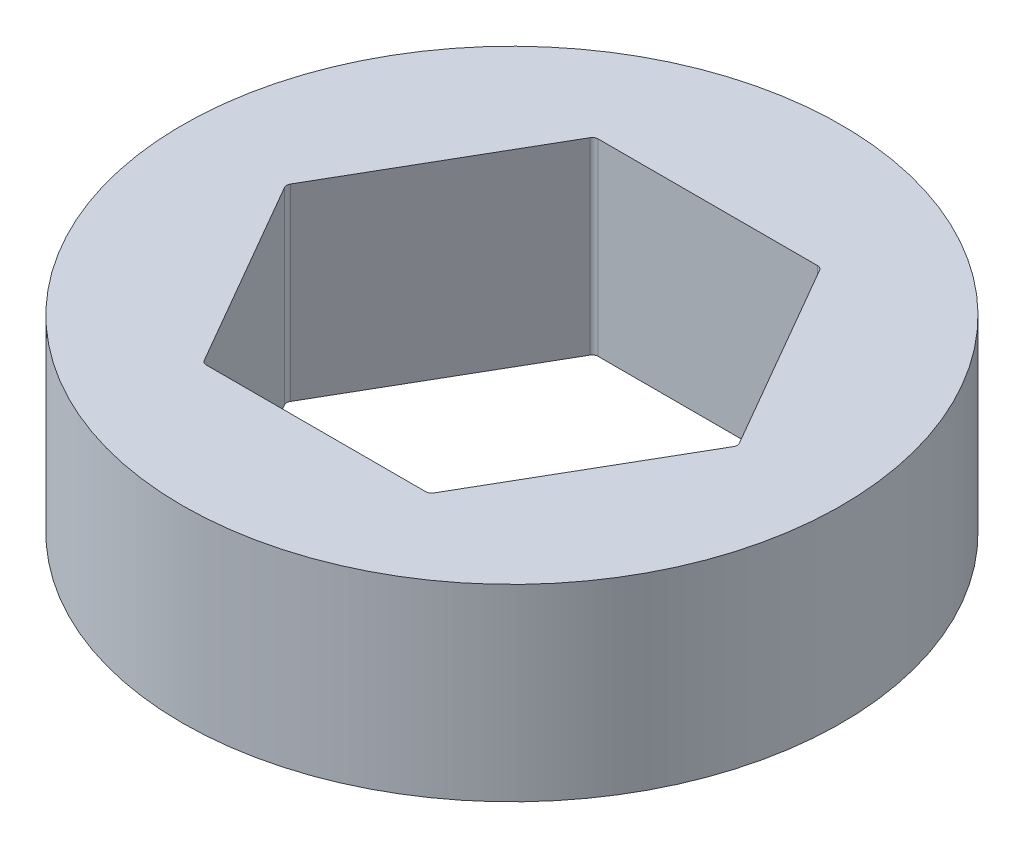
ISO-10303-21;
HEADER;
FILE_DESCRIPTION(('STEP AP214'),'2;1');
FILE_NAME('part.step','',(''),(''),'','','');
FILE_SCHEMA(('AUTOMOTIVE_DESIGN { 1 0 10303 214 1 1 1 1 }'));
ENDSEC;
DATA;
#1=APPLICATION_CONTEXT('core data for automotive mechanical design processes');
#2=APPLICATION_PROTOCOL_DEFINITION('international standard','automotive_design',2000,#1);
#3=PRODUCT_CONTEXT('',#1,'mechanical');
#4=PRODUCT('Part','Part','',(#3));
#5=PRODUCT_RELATED_PRODUCT_CATEGORY('part','',(#4));
#6=PRODUCT_DEFINITION_FORMATION('','',#4);
#7=PRODUCT_DEFINITION_CONTEXT('part definition',#1,'design');
#8=PRODUCT_DEFINITION('design','',#6,#7);
#9=PRODUCT_DEFINITION_SHAPE('','',#8);
#10=(LENGTH_UNIT() NAMED_UNIT(*) SI_UNIT(.MILLI.,.METRE.));
#11=(NAMED_UNIT(*) PLANE_ANGLE_UNIT() SI_UNIT($,.RADIAN.));
#12=(NAMED_UNIT(*) SI_UNIT($,.STERADIAN.) SOLID_ANGLE_UNIT());
#13=UNCERTAINTY_MEASURE_WITH_UNIT(LENGTH_MEASURE(1.E-05),#10,'distance_accuracy_value','');
#14=(GEOMETRIC_REPRESENTATION_CONTEXT(3) GLOBAL_UNCERTAINTY_ASSIGNED_CONTEXT((#13)) GLOBAL_UNIT_ASSIGNED_CONTEXT((#10,
#11,#12)) REPRESENTATION_CONTEXT('',''));
#15=CARTESIAN_POINT('',(0.,0.,0.));
#16=DIRECTION('',(0.,0.,1.));
#17=DIRECTION('',(1.,0.,0.));
#18=AXIS2_PLACEMENT_3D('',#15,#16,#17);
#19=CARTESIAN_POINT('',(0.,6.35,0.));
#20=DIRECTION('',(0.,1.,0.));
#21=DIRECTION('',(0.,0.,1.));
#22=AXIS2_PLACEMENT_3D('',#19,#20,#21);
#23=PLANE('',#22);
#24=CARTESIAN_POINT('',(0.,6.35,0.));
#25=DIRECTION('',(0.,1.,0.));
#26=DIRECTION('',(0.,0.,1.));
#27=AXIS2_PLACEMENT_3D('',#24,#25,#26);
#28=CIRCLE('',#27,11.1125);
#29=CARTESIAN_POINT('',(0.,6.35,11.1125));
#30=VERTEX_POINT('',#29);
#31=EDGE_CURVE('E145',#30,#30,#28,.T.);
#32=ORIENTED_EDGE('',*,*,#31,.T.);
#33=EDGE_LOOP('',(#32));
#34=FACE_BOUND('',#33,.T.);
#35=DIRECTION('',(-0.5,0.,-0.866025403784438));
#36=VECTOR('',#35,1.);
#37=CARTESIAN_POINT('',(7.62564235545658,6.35,0.));
#38=LINE('',#37,#36);
#39=CARTESIAN_POINT('',(7.56790732853761,6.35,-0.100000000000002));
#40=VERTEX_POINT('',#39);
#41=CARTESIAN_POINT('',(3.87055620464725,6.35,-6.504));
#42=VERTEX_POINT('',#41);
#43=EDGE_CURVE('E246',#40,#42,#38,.T.);
#44=ORIENTED_EDGE('',*,*,#43,.F.);
#45=CARTESIAN_POINT('',(7.39470224778073,6.35,0.));
#46=DIRECTION('',(0.,1.,0.));
#47=DIRECTION('',(0.,0.,1.));
#48=AXIS2_PLACEMENT_3D('',#45,#46,#47);
#49=CIRCLE('',#48,0.2);
#50=CARTESIAN_POINT('',(7.56790732853761,6.35,0.0999999999999985));
#51=VERTEX_POINT('',#50);
#52=EDGE_CURVE('E48',#40,#51,#49,.F.);
#53=ORIENTED_EDGE('',*,*,#52,.T.);
#54=DIRECTION('',(0.5,0.,-0.866025403784439));
#55=VECTOR('',#54,1.);
#56=CARTESIAN_POINT('',(3.81282117772829,6.35,6.604));
#57=LINE('',#56,#55);
#58=CARTESIAN_POINT('',(3.87055620464725,6.35,6.50400000000001));
#59=VERTEX_POINT('',#58);
#60=EDGE_CURVE('E204',#59,#51,#57,.T.);
#61=ORIENTED_EDGE('',*,*,#60,.F.);
#62=CARTESIAN_POINT('',(3.69735112389036,6.35,6.40400000000001));
#63=DIRECTION('',(0.,1.,0.));
#64=DIRECTION('',(0.,0.,1.));
#65=AXIS2_PLACEMENT_3D('',#62,#63,#64);
#66=CIRCLE('',#65,0.2);
#67=CARTESIAN_POINT('',(3.69735112389036,6.35,6.604));
#68=VERTEX_POINT('',#67);
#69=EDGE_CURVE('E133',#59,#68,#66,.F.);
#70=ORIENTED_EDGE('',*,*,#69,.T.);
#71=DIRECTION('',(1.,0.,0.));
#72=VECTOR('',#71,1.);
#73=CARTESIAN_POINT('',(-3.81282117772829,6.35,6.604));
#74=LINE('',#73,#72);
#75=CARTESIAN_POINT('',(-3.69735112389036,6.35,6.604));
#76=VERTEX_POINT('',#75);
#77=EDGE_CURVE('E211',#76,#68,#74,.T.);
#78=ORIENTED_EDGE('',*,*,#77,.F.);
#79=CARTESIAN_POINT('',(-3.69735112389036,6.35,6.40400000000001));
#80=DIRECTION('',(0.,1.,0.));
#81=DIRECTION('',(0.,0.,1.));
#82=AXIS2_PLACEMENT_3D('',#79,#80,#81);
#83=CIRCLE('',#82,0.2);
#84=CARTESIAN_POINT('',(-3.87055620464725,6.35,6.50400000000001));
#85=VERTEX_POINT('',#84);
#86=EDGE_CURVE('E11',#76,#85,#83,.F.);
#87=ORIENTED_EDGE('',*,*,#86,.T.);
#88=DIRECTION('',(0.5,0.,0.866025403784439));
#89=VECTOR('',#88,1.);
#90=CARTESIAN_POINT('',(-7.62564235545658,6.35,0.));
#91=LINE('',#90,#89);
#92=CARTESIAN_POINT('',(-7.56790732853762,6.35,0.1));
#93=VERTEX_POINT('',#92);
#94=EDGE_CURVE('E209',#93,#85,#91,.T.);
#95=ORIENTED_EDGE('',*,*,#94,.F.);
#96=CARTESIAN_POINT('',(-7.39470224778073,6.35,0.));
#97=DIRECTION('',(0.,1.,0.));
#98=DIRECTION('',(0.,0.,1.));
#99=AXIS2_PLACEMENT_3D('',#96,#97,#98);
#100=CIRCLE('',#99,0.2);
#101=CARTESIAN_POINT('',(-7.56790732853762,6.35,-0.0999999999999994));
#102=VERTEX_POINT('',#101);
#103=EDGE_CURVE('E186',#93,#102,#100,.F.);
#104=ORIENTED_EDGE('',*,*,#103,.T.);
#105=DIRECTION('',(-0.5,0.,0.866025403784439));
#106=VECTOR('',#105,1.);
#107=CARTESIAN_POINT('',(-3.81282117772829,6.35,-6.604));
#108=LINE('',#107,#106);
#109=CARTESIAN_POINT('',(-3.87055620464725,6.35,-6.504));
#110=VERTEX_POINT('',#109);
#111=EDGE_CURVE('E215',#110,#102,#108,.T.);
#112=ORIENTED_EDGE('',*,*,#111,.F.);
#113=CARTESIAN_POINT('',(-3.69735112389037,6.35,-6.404));
#114=DIRECTION('',(0.,1.,0.));
#115=DIRECTION('',(0.,0.,1.));
#116=AXIS2_PLACEMENT_3D('',#113,#114,#115);
#117=CIRCLE('',#116,0.2);
#118=CARTESIAN_POINT('',(-3.69735112389037,6.35,-6.604));
#119=VERTEX_POINT('',#118);
#120=EDGE_CURVE('E182',#110,#119,#117,.F.);
#121=ORIENTED_EDGE('',*,*,#120,.T.);
#122=DIRECTION('',(-1.,0.,0.));
#123=VECTOR('',#122,1.);
#124=CARTESIAN_POINT('',(3.81282117772829,6.35,-6.604));
#125=LINE('',#124,#123);
#126=CARTESIAN_POINT('',(3.69735112389036,6.35,-6.604));
#127=VERTEX_POINT('',#126);
#128=EDGE_CURVE('E219',#127,#119,#125,.T.);
#129=ORIENTED_EDGE('',*,*,#128,.F.);
#130=CARTESIAN_POINT('',(3.69735112389036,6.35,-6.404));
#131=DIRECTION('',(0.,1.,0.));
#132=DIRECTION('',(0.,0.,1.));
#133=AXIS2_PLACEMENT_3D('',#130,#131,#132);
#134=CIRCLE('',#133,0.2);
#135=EDGE_CURVE('E178',#127,#42,#134,.F.);
#136=ORIENTED_EDGE('',*,*,#135,.T.);
#137=EDGE_LOOP('',(#44,#53,#61,#70,#78,#87,#95,#104,#112,#121,#129,#136));
#138=FACE_BOUND('',#137,.T.);
#139=ADVANCED_FACE('F33',(#34,#138),#23,.T.);
#140=CARTESIAN_POINT('',(0.,0.,0.));
#141=DIRECTION('',(0.,1.,0.));
#142=DIRECTION('',(0.,0.,1.));
#143=AXIS2_PLACEMENT_3D('',#140,#141,#142);
#144=PLANE('',#143);
#145=CARTESIAN_POINT('',(0.,0.,0.));
#146=DIRECTION('',(0.,1.,0.));
#147=DIRECTION('',(0.,0.,1.));
#148=AXIS2_PLACEMENT_3D('',#145,#146,#147);
#149=CIRCLE('',#148,11.1125);
#150=CARTESIAN_POINT('',(0.,0.,11.1125));
#151=VERTEX_POINT('',#150);
#152=EDGE_CURVE('E150',#151,#151,#149,.T.);
#153=ORIENTED_EDGE('',*,*,#152,.F.);
#154=EDGE_LOOP('',(#153));
#155=FACE_BOUND('',#154,.T.);
#156=DIRECTION('',(1.,0.,0.));
#157=VECTOR('',#156,1.);
#158=CARTESIAN_POINT('',(-3.81282117772829,0.,6.604));
#159=LINE('',#158,#157);
#160=CARTESIAN_POINT('',(-3.69735112389036,0.,6.604));
#161=VERTEX_POINT('',#160);
#162=CARTESIAN_POINT('',(3.69735112389036,0.,6.604));
#163=VERTEX_POINT('',#162);
#164=EDGE_CURVE('E193',#161,#163,#159,.T.);
#165=ORIENTED_EDGE('',*,*,#164,.T.);
#166=CARTESIAN_POINT('',(3.69735112389036,0.,6.40400000000001));
#167=DIRECTION('',(0.,1.,0.));
#168=DIRECTION('',(0.,0.,1.));
#169=AXIS2_PLACEMENT_3D('',#166,#167,#168);
#170=CIRCLE('',#169,0.2);
#171=CARTESIAN_POINT('',(3.87055620464725,0.,6.50400000000001));
#172=VERTEX_POINT('',#171);
#173=EDGE_CURVE('E188',#163,#172,#170,.T.);
#174=ORIENTED_EDGE('',*,*,#173,.T.);
#175=DIRECTION('',(0.5,0.,-0.866025403784439));
#176=VECTOR('',#175,1.);
#177=CARTESIAN_POINT('',(3.81282117772829,0.,6.604));
#178=LINE('',#177,#176);
#179=CARTESIAN_POINT('',(7.56790732853761,0.,0.0999999999999985));
#180=VERTEX_POINT('',#179);
#181=EDGE_CURVE('E128',#172,#180,#178,.T.);
#182=ORIENTED_EDGE('',*,*,#181,.T.);
#183=CARTESIAN_POINT('',(7.39470224778073,0.,0.));
#184=DIRECTION('',(0.,1.,0.));
#185=DIRECTION('',(0.,0.,1.));
#186=AXIS2_PLACEMENT_3D('',#183,#184,#185);
#187=CIRCLE('',#186,0.2);
#188=CARTESIAN_POINT('',(7.56790732853761,0.,-0.100000000000002));
#189=VERTEX_POINT('',#188);
#190=EDGE_CURVE('E123',#180,#189,#187,.T.);
#191=ORIENTED_EDGE('',*,*,#190,.T.);
#192=DIRECTION('',(-0.5,0.,-0.866025403784438));
#193=VECTOR('',#192,1.);
#194=CARTESIAN_POINT('',(7.62564235545658,0.,0.));
#195=LINE('',#194,#193);
#196=CARTESIAN_POINT('',(3.87055620464725,0.,-6.504));
#197=VERTEX_POINT('',#196);
#198=EDGE_CURVE('E127',#189,#197,#195,.T.);
#199=ORIENTED_EDGE('',*,*,#198,.T.);
#200=CARTESIAN_POINT('',(3.69735112389036,0.,-6.404));
#201=DIRECTION('',(0.,1.,0.));
#202=DIRECTION('',(0.,0.,1.));
#203=AXIS2_PLACEMENT_3D('',#200,#201,#202);
#204=CIRCLE('',#203,0.2);
#205=CARTESIAN_POINT('',(3.69735112389036,0.,-6.604));
#206=VERTEX_POINT('',#205);
#207=EDGE_CURVE('E176',#197,#206,#204,.T.);
#208=ORIENTED_EDGE('',*,*,#207,.T.);
#209=DIRECTION('',(-1.,0.,0.));
#210=VECTOR('',#209,1.);
#211=CARTESIAN_POINT('',(3.81282117772829,0.,-6.604));
#212=LINE('',#211,#210);
#213=CARTESIAN_POINT('',(-3.69735112389037,0.,-6.604));
#214=VERTEX_POINT('',#213);
#215=EDGE_CURVE('E142',#206,#214,#212,.T.);
#216=ORIENTED_EDGE('',*,*,#215,.T.);
#217=CARTESIAN_POINT('',(-3.69735112389037,0.,-6.404));
#218=DIRECTION('',(0.,1.,0.));
#219=DIRECTION('',(0.,0.,1.));
#220=AXIS2_PLACEMENT_3D('',#217,#218,#219);
#221=CIRCLE('',#220,0.2);
#222=CARTESIAN_POINT('',(-3.87055620464725,0.,-6.504));
#223=VERTEX_POINT('',#222);
#224=EDGE_CURVE('E180',#214,#223,#221,.T.);
#225=ORIENTED_EDGE('',*,*,#224,.T.);
#226=DIRECTION('',(-0.5,0.,0.866025403784439));
#227=VECTOR('',#226,1.);
#228=CARTESIAN_POINT('',(-3.81282117772829,0.,-6.604));
#229=LINE('',#228,#227);
#230=CARTESIAN_POINT('',(-7.56790732853762,0.,-0.0999999999999994));
#231=VERTEX_POINT('',#230);
#232=EDGE_CURVE('E226',#223,#231,#229,.T.);
#233=ORIENTED_EDGE('',*,*,#232,.T.);
#234=CARTESIAN_POINT('',(-7.39470224778073,0.,0.));
#235=DIRECTION('',(0.,1.,0.));
#236=DIRECTION('',(0.,0.,1.));
#237=AXIS2_PLACEMENT_3D('',#234,#235,#236);
#238=CIRCLE('',#237,0.2);
#239=CARTESIAN_POINT('',(-7.56790732853762,0.,0.1));
#240=VERTEX_POINT('',#239);
#241=EDGE_CURVE('E184',#231,#240,#238,.T.);
#242=ORIENTED_EDGE('',*,*,#241,.T.);
#243=DIRECTION('',(0.5,0.,0.866025403784439));
#244=VECTOR('',#243,1.);
#245=CARTESIAN_POINT('',(-7.62564235545658,0.,0.));
#246=LINE('',#245,#244);
#247=CARTESIAN_POINT('',(-3.87055620464725,0.,6.50400000000001));
#248=VERTEX_POINT('',#247);
#249=EDGE_CURVE('E195',#240,#248,#246,.T.);
#250=ORIENTED_EDGE('',*,*,#249,.T.);
#251=CARTESIAN_POINT('',(-3.69735112389036,0.,6.40400000000001));
#252=DIRECTION('',(0.,1.,0.));
#253=DIRECTION('',(0.,0.,1.));
#254=AXIS2_PLACEMENT_3D('',#251,#252,#253);
#255=CIRCLE('',#254,0.2);
#256=EDGE_CURVE('E41',#248,#161,#255,.T.);
#257=ORIENTED_EDGE('',*,*,#256,.T.);
#258=EDGE_LOOP('',(#165,#174,#182,#191,#199,#208,#216,#225,#233,#242,#250,#257));
#259=FACE_BOUND('',#258,.T.);
#260=ADVANCED_FACE('F126',(#155,#259),#144,.F.);
#261=CARTESIAN_POINT('',(0.,6.35,0.));
#262=DIRECTION('',(0.,-1.,0.));
#263=DIRECTION('',(0.,0.,-1.));
#264=AXIS2_PLACEMENT_3D('',#261,#262,#263);
#265=CYLINDRICAL_SURFACE('',#264,11.1125);
#266=ORIENTED_EDGE('',*,*,#31,.F.);
#267=EDGE_LOOP('',(#266));
#268=FACE_BOUND('',#267,.T.);
#269=ORIENTED_EDGE('',*,*,#152,.T.);
#270=EDGE_LOOP('',(#269));
#271=FACE_BOUND('',#270,.T.);
#272=ADVANCED_FACE('F268',(#268,#271),#265,.T.);
#273=CARTESIAN_POINT('',(3.81282117772829,6.35,6.604));
#274=DIRECTION('',(-0.866025403784439,0.,-0.5));
#275=DIRECTION('',(-0.5,0.,0.866025403784439));
#276=AXIS2_PLACEMENT_3D('',#273,#274,#275);
#277=PLANE('',#276);
#278=ORIENTED_EDGE('',*,*,#181,.F.);
#279=DIRECTION('',(0.,-1.,0.));
#280=VECTOR('',#279,1.);
#281=CARTESIAN_POINT('',(3.87055620464725,6.35,6.50400000000001));
#282=LINE('',#281,#280);
#283=EDGE_CURVE('E55',#172,#59,#282,.F.);
#284=ORIENTED_EDGE('',*,*,#283,.T.);
#285=ORIENTED_EDGE('',*,*,#60,.T.);
#286=DIRECTION('',(0.,-1.,0.));
#287=VECTOR('',#286,1.);
#288=CARTESIAN_POINT('',(7.56790732853761,0.,0.0999999999999983));
#289=LINE('',#288,#287);
#290=EDGE_CURVE('E173',#51,#180,#289,.T.);
#291=ORIENTED_EDGE('',*,*,#290,.T.);
#292=EDGE_LOOP('',(#278,#284,#285,#291));
#293=FACE_BOUND('',#292,.T.);
#294=ADVANCED_FACE('F249',(#293),#277,.T.);
#295=CARTESIAN_POINT('',(7.62564235545658,6.35,0.));
#296=DIRECTION('',(-0.866025403784438,0.,0.5));
#297=DIRECTION('',(0.5,0.,0.866025403784439));
#298=AXIS2_PLACEMENT_3D('',#295,#296,#297);
#299=PLANE('',#298);
#300=ORIENTED_EDGE('',*,*,#43,.T.);
#301=DIRECTION('',(0.,-1.,0.));
#302=VECTOR('',#301,1.);
#303=CARTESIAN_POINT('',(3.87055620464725,0.,-6.504));
#304=LINE('',#303,#302);
#305=EDGE_CURVE('E141',#42,#197,#304,.T.);
#306=ORIENTED_EDGE('',*,*,#305,.T.);
#307=ORIENTED_EDGE('',*,*,#198,.F.);
#308=DIRECTION('',(0.,-1.,0.));
#309=VECTOR('',#308,1.);
#310=CARTESIAN_POINT('',(7.56790732853761,6.35,-0.100000000000002));
#311=LINE('',#310,#309);
#312=EDGE_CURVE('E139',#189,#40,#311,.F.);
#313=ORIENTED_EDGE('',*,*,#312,.T.);
#314=EDGE_LOOP('',(#300,#306,#307,#313));
#315=FACE_BOUND('',#314,.T.);
#316=ADVANCED_FACE('F138',(#315),#299,.T.);
#317=CARTESIAN_POINT('',(3.81282117772829,6.35,-6.604));
#318=DIRECTION('',(0.,0.,1.));
#319=DIRECTION('',(1.,0.,0.));
#320=AXIS2_PLACEMENT_3D('',#317,#318,#319);
#321=PLANE('',#320);
#322=ORIENTED_EDGE('',*,*,#215,.F.);
#323=DIRECTION('',(0.,-1.,0.));
#324=VECTOR('',#323,1.);
#325=CARTESIAN_POINT('',(3.69735112389036,6.35,-6.604));
#326=LINE('',#325,#324);
#327=EDGE_CURVE('E156',#206,#127,#326,.F.);
#328=ORIENTED_EDGE('',*,*,#327,.T.);
#329=ORIENTED_EDGE('',*,*,#128,.T.);
#330=DIRECTION('',(0.,-1.,0.));
#331=VECTOR('',#330,1.);
#332=CARTESIAN_POINT('',(-3.69735112389037,0.,-6.604));
#333=LINE('',#332,#331);
#334=EDGE_CURVE('E147',#119,#214,#333,.T.);
#335=ORIENTED_EDGE('',*,*,#334,.T.);
#336=EDGE_LOOP('',(#322,#328,#329,#335));
#337=FACE_BOUND('',#336,.T.);
#338=ADVANCED_FACE('F244',(#337),#321,.T.);
#339=CARTESIAN_POINT('',(-3.81282117772829,6.35,-6.604));
#340=DIRECTION('',(0.866025403784439,0.,0.5));
#341=DIRECTION('',(0.5,0.,-0.866025403784439));
#342=AXIS2_PLACEMENT_3D('',#339,#340,#341);
#343=PLANE('',#342);
#344=ORIENTED_EDGE('',*,*,#232,.F.);
#345=DIRECTION('',(0.,-1.,0.));
#346=VECTOR('',#345,1.);
#347=CARTESIAN_POINT('',(-3.87055620464725,6.35,-6.504));
#348=LINE('',#347,#346);
#349=EDGE_CURVE('E161',#223,#110,#348,.F.);
#350=ORIENTED_EDGE('',*,*,#349,.T.);
#351=ORIENTED_EDGE('',*,*,#111,.T.);
#352=DIRECTION('',(0.,-1.,0.));
#353=VECTOR('',#352,1.);
#354=CARTESIAN_POINT('',(-7.56790732853762,0.,-0.0999999999999989));
#355=LINE('',#354,#353);
#356=EDGE_CURVE('E158',#102,#231,#355,.T.);
#357=ORIENTED_EDGE('',*,*,#356,.T.);
#358=EDGE_LOOP('',(#344,#350,#351,#357));
#359=FACE_BOUND('',#358,.T.);
#360=ADVANCED_FACE('F232',(#359),#343,.T.);
#361=CARTESIAN_POINT('',(-7.62564235545658,6.35,0.));
#362=DIRECTION('',(0.866025403784439,0.,-0.5));
#363=DIRECTION('',(-0.5,0.,-0.866025403784439));
#364=AXIS2_PLACEMENT_3D('',#361,#362,#363);
#365=PLANE('',#364);
#366=ORIENTED_EDGE('',*,*,#249,.F.);
#367=DIRECTION('',(0.,-1.,0.));
#368=VECTOR('',#367,1.);
#369=CARTESIAN_POINT('',(-7.56790732853762,6.35,0.1));
#370=LINE('',#369,#368);
#371=EDGE_CURVE('E166',#240,#93,#370,.F.);
#372=ORIENTED_EDGE('',*,*,#371,.T.);
#373=ORIENTED_EDGE('',*,*,#94,.T.);
#374=DIRECTION('',(0.,-1.,0.));
#375=VECTOR('',#374,1.);
#376=CARTESIAN_POINT('',(-3.87055620464725,0.,6.504));
#377=LINE('',#376,#375);
#378=EDGE_CURVE('E163',#85,#248,#377,.T.);
#379=ORIENTED_EDGE('',*,*,#378,.T.);
#380=EDGE_LOOP('',(#366,#372,#373,#379));
#381=FACE_BOUND('',#380,.T.);
#382=ADVANCED_FACE('F213',(#381),#365,.T.);
#383=CARTESIAN_POINT('',(-3.81282117772829,6.35,6.604));
#384=DIRECTION('',(0.,0.,-1.));
#385=DIRECTION('',(-1.,0.,0.));
#386=AXIS2_PLACEMENT_3D('',#383,#384,#385);
#387=PLANE('',#386);
#388=ORIENTED_EDGE('',*,*,#77,.T.);
#389=DIRECTION('',(0.,-1.,0.));
#390=VECTOR('',#389,1.);
#391=CARTESIAN_POINT('',(3.69735112389036,0.,6.604));
#392=LINE('',#391,#390);
#393=EDGE_CURVE('E170',#68,#163,#392,.T.);
#394=ORIENTED_EDGE('',*,*,#393,.T.);
#395=ORIENTED_EDGE('',*,*,#164,.F.);
#396=DIRECTION('',(0.,-1.,0.));
#397=VECTOR('',#396,1.);
#398=CARTESIAN_POINT('',(-3.69735112389036,6.35,6.604));
#399=LINE('',#398,#397);
#400=EDGE_CURVE('E168',#161,#76,#399,.F.);
#401=ORIENTED_EDGE('',*,*,#400,.T.);
#402=EDGE_LOOP('',(#388,#394,#395,#401));
#403=FACE_BOUND('',#402,.T.);
#404=ADVANCED_FACE('F201',(#403),#387,.T.);
#405=CARTESIAN_POINT('',(3.69735112389036,6.35,-6.404));
#406=DIRECTION('',(0.,1.,0.));
#407=DIRECTION('',(0.,0.,1.));
#408=AXIS2_PLACEMENT_3D('',#405,#406,#407);
#409=CYLINDRICAL_SURFACE('',#408,0.2);
#410=ORIENTED_EDGE('',*,*,#135,.F.);
#411=ORIENTED_EDGE('',*,*,#327,.F.);
#412=ORIENTED_EDGE('',*,*,#207,.F.);
#413=ORIENTED_EDGE('',*,*,#305,.F.);
#414=EDGE_LOOP('',(#410,#411,#412,#413));
#415=FACE_BOUND('',#414,.T.);
#416=ADVANCED_FACE('F277',(#415),#409,.F.);
#417=CARTESIAN_POINT('',(-3.69735112389037,6.35,-6.404));
#418=DIRECTION('',(0.,1.,0.));
#419=DIRECTION('',(0.,0.,1.));
#420=AXIS2_PLACEMENT_3D('',#417,#418,#419);
#421=CYLINDRICAL_SURFACE('',#420,0.2);
#422=ORIENTED_EDGE('',*,*,#120,.F.);
#423=ORIENTED_EDGE('',*,*,#349,.F.);
#424=ORIENTED_EDGE('',*,*,#224,.F.);
#425=ORIENTED_EDGE('',*,*,#334,.F.);
#426=EDGE_LOOP('',(#422,#423,#424,#425));
#427=FACE_BOUND('',#426,.T.);
#428=ADVANCED_FACE('F237',(#427),#421,.F.);
#429=CARTESIAN_POINT('',(-7.39470224778073,6.35,0.));
#430=DIRECTION('',(0.,1.,0.));
#431=DIRECTION('',(0.,0.,1.));
#432=AXIS2_PLACEMENT_3D('',#429,#430,#431);
#433=CYLINDRICAL_SURFACE('',#432,0.2);
#434=ORIENTED_EDGE('',*,*,#103,.F.);
#435=ORIENTED_EDGE('',*,*,#371,.F.);
#436=ORIENTED_EDGE('',*,*,#241,.F.);
#437=ORIENTED_EDGE('',*,*,#356,.F.);
#438=EDGE_LOOP('',(#434,#435,#436,#437));
#439=FACE_BOUND('',#438,.T.);
#440=ADVANCED_FACE('F254',(#439),#433,.F.);
#441=CARTESIAN_POINT('',(3.69735112389036,6.35,6.40400000000001));
#442=DIRECTION('',(0.,1.,0.));
#443=DIRECTION('',(0.,0.,1.));
#444=AXIS2_PLACEMENT_3D('',#441,#442,#443);
#445=CYLINDRICAL_SURFACE('',#444,0.2);
#446=ORIENTED_EDGE('',*,*,#69,.F.);
#447=ORIENTED_EDGE('',*,*,#283,.F.);
#448=ORIENTED_EDGE('',*,*,#173,.F.);
#449=ORIENTED_EDGE('',*,*,#393,.F.);
#450=EDGE_LOOP('',(#446,#447,#448,#449));
#451=FACE_BOUND('',#450,.T.);
#452=ADVANCED_FACE('F252',(#451),#445,.F.);
#453=CARTESIAN_POINT('',(7.39470224778073,6.35,0.));
#454=DIRECTION('',(0.,1.,0.));
#455=DIRECTION('',(0.,0.,1.));
#456=AXIS2_PLACEMENT_3D('',#453,#454,#455);
#457=CYLINDRICAL_SURFACE('',#456,0.2);
#458=ORIENTED_EDGE('',*,*,#52,.F.);
#459=ORIENTED_EDGE('',*,*,#312,.F.);
#460=ORIENTED_EDGE('',*,*,#190,.F.);
#461=ORIENTED_EDGE('',*,*,#290,.F.);
#462=EDGE_LOOP('',(#458,#459,#460,#461));
#463=FACE_BOUND('',#462,.T.);
#464=ADVANCED_FACE('F144',(#463),#457,.F.);
#465=CARTESIAN_POINT('',(-3.69735112389036,6.35,6.40400000000001));
#466=DIRECTION('',(0.,1.,0.));
#467=DIRECTION('',(0.,0.,1.));
#468=AXIS2_PLACEMENT_3D('',#465,#466,#467);
#469=CYLINDRICAL_SURFACE('',#468,0.2);
#470=ORIENTED_EDGE('',*,*,#86,.F.);
#471=ORIENTED_EDGE('',*,*,#400,.F.);
#472=ORIENTED_EDGE('',*,*,#256,.F.);
#473=ORIENTED_EDGE('',*,*,#378,.F.);
#474=EDGE_LOOP('',(#470,#471,#472,#473));
#475=FACE_BOUND('',#474,.T.);
#476=ADVANCED_FACE('F35',(#475),#469,.F.);
#477=CLOSED_SHELL('',(#139,#260,#272,#294,#316,#338,#360,#382,#404,#416,#428,#440,#452,#464,#476));
#478=MANIFOLD_SOLID_BREP('B2',#477);
#479=ADVANCED_BREP_SHAPE_REPRESENTATION('',(#18,#478),#14);
#480=SHAPE_DEFINITION_REPRESENTATION(#9,#479);
ENDSEC;
END-ISO-10303-21;
